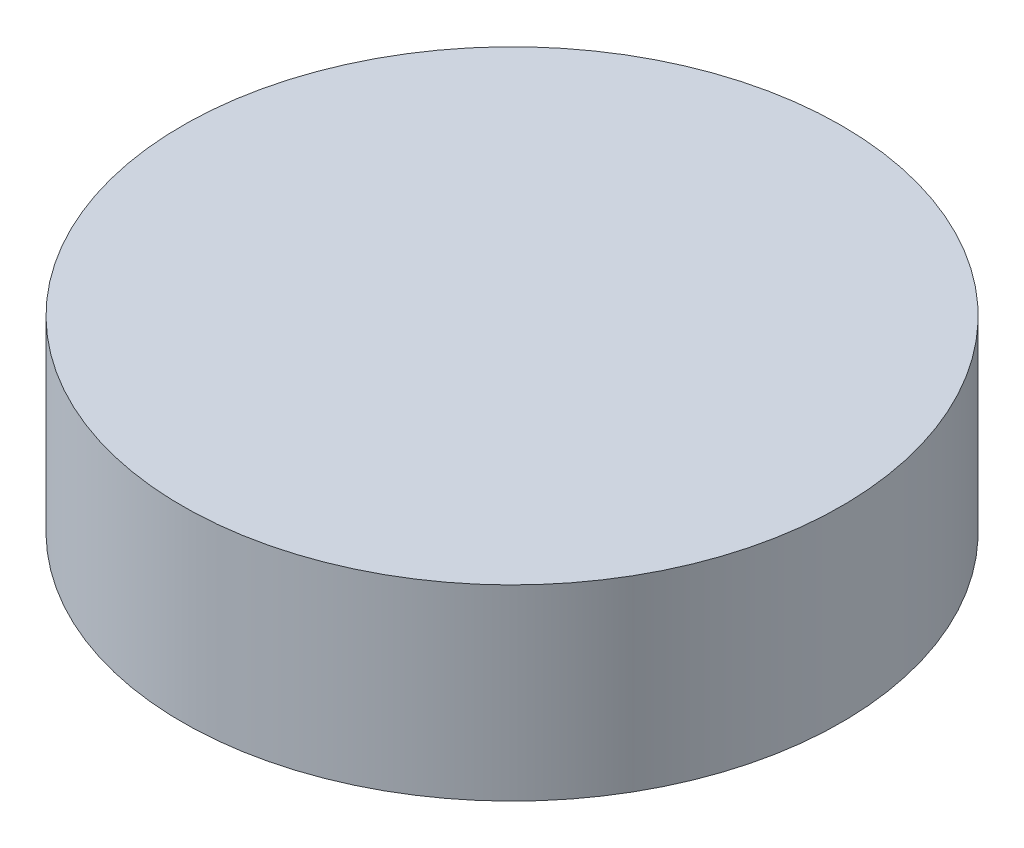
ISO-10303-21;
HEADER;
FILE_DESCRIPTION(('STEP AP214'),'2;1');
FILE_NAME('part.step','',(''),(''),'','','');
FILE_SCHEMA(('AUTOMOTIVE_DESIGN { 1 0 10303 214 1 1 1 1 }'));
ENDSEC;
DATA;
#1=APPLICATION_CONTEXT('core data for automotive mechanical design processes');
#2=APPLICATION_PROTOCOL_DEFINITION('international standard','automotive_design',2000,#1);
#3=PRODUCT_CONTEXT('',#1,'mechanical');
#4=PRODUCT('Part','Part','',(#3));
#5=PRODUCT_RELATED_PRODUCT_CATEGORY('part','',(#4));
#6=PRODUCT_DEFINITION_FORMATION('','',#4);
#7=PRODUCT_DEFINITION_CONTEXT('part definition',#1,'design');
#8=PRODUCT_DEFINITION('design','',#6,#7);
#9=PRODUCT_DEFINITION_SHAPE('','',#8);
#10=(LENGTH_UNIT() NAMED_UNIT(*) SI_UNIT(.MILLI.,.METRE.));
#11=(NAMED_UNIT(*) PLANE_ANGLE_UNIT() SI_UNIT($,.RADIAN.));
#12=(NAMED_UNIT(*) SI_UNIT($,.STERADIAN.) SOLID_ANGLE_UNIT());
#13=UNCERTAINTY_MEASURE_WITH_UNIT(LENGTH_MEASURE(1.E-05),#10,'distance_accuracy_value','');
#14=(GEOMETRIC_REPRESENTATION_CONTEXT(3) GLOBAL_UNCERTAINTY_ASSIGNED_CONTEXT((#13)) GLOBAL_UNIT_ASSIGNED_CONTEXT((#10,
#11,#12)) REPRESENTATION_CONTEXT('',''));
#15=CARTESIAN_POINT('',(0.,0.,0.));
#16=DIRECTION('',(0.,0.,1.));
#17=DIRECTION('',(1.,0.,0.));
#18=AXIS2_PLACEMENT_3D('',#15,#16,#17);
#19=CARTESIAN_POINT('',(0.,152.4,0.));
#20=DIRECTION('',(0.,-1.,0.));
#21=DIRECTION('',(0.,0.,-1.));
#22=AXIS2_PLACEMENT_3D('',#19,#20,#21);
#23=CYLINDRICAL_SURFACE('',#22,268.216999097013);
#24=CARTESIAN_POINT('',(0.,152.4,0.));
#25=DIRECTION('',(0.,1.,0.));
#26=DIRECTION('',(0.,0.,1.));
#27=AXIS2_PLACEMENT_3D('',#24,#25,#26);
#28=CIRCLE('',#27,268.216999097013);
#29=CARTESIAN_POINT('',(0.,152.4,-268.216999097013));
#30=VERTEX_POINT('',#29);
#31=EDGE_CURVE('E10',#30,#30,#28,.T.);
#32=CARTESIAN_POINT('',(0.,0.,0.));
#33=DIRECTION('',(0.,1.,0.));
#34=DIRECTION('',(0.,0.,1.));
#35=AXIS2_PLACEMENT_3D('',#32,#33,#34);
#36=CIRCLE('',#35,268.216999097013);
#37=CARTESIAN_POINT('',(0.,0.,-268.216999097013));
#38=VERTEX_POINT('',#37);
#39=EDGE_CURVE('E34',#38,#38,#36,.T.);
#40=CARTESIAN_POINT('',(0.,152.4,-268.216999097013));
#41=CARTESIAN_POINT('',(0.,150.8125,-268.216999097013));
#42=CARTESIAN_POINT('',(0.,149.225,-268.216999097013));
#43=CARTESIAN_POINT('',(0.,146.05,-268.216999097013));
#44=CARTESIAN_POINT('',(0.,144.4625,-268.216999097013));
#45=CARTESIAN_POINT('',(0.,141.2875,-268.216999097013));
#46=CARTESIAN_POINT('',(0.,139.7,-268.216999097013));
#47=CARTESIAN_POINT('',(0.,136.525,-268.216999097013));
#48=CARTESIAN_POINT('',(0.,134.9375,-268.216999097013));
#49=CARTESIAN_POINT('',(0.,131.7625,-268.216999097013));
#50=CARTESIAN_POINT('',(0.,130.175,-268.216999097013));
#51=CARTESIAN_POINT('',(0.,127.,-268.216999097013));
#52=CARTESIAN_POINT('',(0.,125.4125,-268.216999097013));
#53=CARTESIAN_POINT('',(0.,122.2375,-268.216999097013));
#54=CARTESIAN_POINT('',(0.,120.65,-268.216999097013));
#55=CARTESIAN_POINT('',(0.,117.475,-268.216999097013));
#56=CARTESIAN_POINT('',(0.,115.8875,-268.216999097013));
#57=CARTESIAN_POINT('',(0.,112.7125,-268.216999097013));
#58=CARTESIAN_POINT('',(0.,111.125,-268.216999097013));
#59=CARTESIAN_POINT('',(0.,107.95,-268.216999097013));
#60=CARTESIAN_POINT('',(0.,106.3625,-268.216999097013));
#61=CARTESIAN_POINT('',(0.,103.1875,-268.216999097013));
#62=CARTESIAN_POINT('',(0.,101.6,-268.216999097013));
#63=CARTESIAN_POINT('',(0.,98.425,-268.216999097013));
#64=CARTESIAN_POINT('',(0.,96.8375,-268.216999097013));
#65=CARTESIAN_POINT('',(0.,93.6625,-268.216999097013));
#66=CARTESIAN_POINT('',(0.,92.075,-268.216999097013));
#67=CARTESIAN_POINT('',(0.,88.9,-268.216999097013));
#68=CARTESIAN_POINT('',(0.,87.3125,-268.216999097013));
#69=CARTESIAN_POINT('',(0.,84.1375,-268.216999097013));
#70=CARTESIAN_POINT('',(0.,82.55,-268.216999097013));
#71=CARTESIAN_POINT('',(0.,79.375,-268.216999097013));
#72=CARTESIAN_POINT('',(0.,77.7875,-268.216999097013));
#73=CARTESIAN_POINT('',(0.,74.6125,-268.216999097013));
#74=CARTESIAN_POINT('',(0.,73.025,-268.216999097013));
#75=CARTESIAN_POINT('',(0.,69.85,-268.216999097013));
#76=CARTESIAN_POINT('',(0.,68.2625,-268.216999097013));
#77=CARTESIAN_POINT('',(0.,65.0875,-268.216999097013));
#78=CARTESIAN_POINT('',(0.,63.5,-268.216999097013));
#79=CARTESIAN_POINT('',(0.,60.325,-268.216999097013));
#80=CARTESIAN_POINT('',(0.,58.7375,-268.216999097013));
#81=CARTESIAN_POINT('',(0.,55.5625,-268.216999097013));
#82=CARTESIAN_POINT('',(0.,53.975,-268.216999097013));
#83=CARTESIAN_POINT('',(0.,50.8,-268.216999097013));
#84=CARTESIAN_POINT('',(0.,49.2125,-268.216999097013));
#85=CARTESIAN_POINT('',(0.,46.0375,-268.216999097013));
#86=CARTESIAN_POINT('',(0.,44.45,-268.216999097013));
#87=CARTESIAN_POINT('',(0.,41.275,-268.216999097013));
#88=CARTESIAN_POINT('',(0.,39.6875,-268.216999097013));
#89=CARTESIAN_POINT('',(0.,36.5125,-268.216999097013));
#90=CARTESIAN_POINT('',(0.,34.925,-268.216999097013));
#91=CARTESIAN_POINT('',(0.,31.75,-268.216999097013));
#92=CARTESIAN_POINT('',(0.,30.1625,-268.216999097013));
#93=CARTESIAN_POINT('',(0.,26.9875,-268.216999097013));
#94=CARTESIAN_POINT('',(0.,25.4,-268.216999097013));
#95=CARTESIAN_POINT('',(0.,22.225,-268.216999097013));
#96=CARTESIAN_POINT('',(0.,20.6375,-268.216999097013));
#97=CARTESIAN_POINT('',(0.,17.4625,-268.216999097013));
#98=CARTESIAN_POINT('',(0.,15.875,-268.216999097013));
#99=CARTESIAN_POINT('',(0.,12.7,-268.216999097013));
#100=CARTESIAN_POINT('',(0.,11.1125,-268.216999097013));
#101=CARTESIAN_POINT('',(0.,7.93750000000001,-268.216999097013));
#102=CARTESIAN_POINT('',(0.,6.35,-268.216999097013));
#103=CARTESIAN_POINT('',(0.,3.175,-268.216999097013));
#104=CARTESIAN_POINT('',(0.,1.5875,-268.216999097013));
#105=CARTESIAN_POINT('',(0.,0.,-268.216999097013));
#106=B_SPLINE_CURVE_WITH_KNOTS('',3,(#40,#41,#42,#43,#44,#45,#46,#47,#48,#49,#50,#51,#52,#53,
#54,#55,#56,#57,#58,#59,#60,#61,#62,#63,#64,#65,#66,#67,#68,#69,#70,#71,#72,#73,#74,#75,#76,#77,
#78,#79,#80,#81,#82,#83,#84,#85,#86,#87,#88,#89,#90,#91,#92,#93,#94,#95,#96,#97,#98,#99,#100,
#101,#102,#103,#104,#105),.UNSPECIFIED.,.F.,.F.,(4,2,2,2,2,2,2,2,2,2,2,2,2,2,2,2,2,2,2,2,2,2,2,
2,2,2,2,2,2,2,2,2,4),(0.,4.7625,9.52500000000001,14.2875,19.05,23.8125,28.575,33.3375,38.1,
42.8625,47.625,52.3875,57.15,61.9125,66.675,71.4375,76.2,80.9625,85.725,90.4875,95.25,100.0125,
104.775,109.5375,114.3,119.0625,123.825,128.5875,133.35,138.1125,142.875,147.6375,152.4),.UNSPECIFIED.);
#107=EDGE_CURVE('BSEAM31',#30,#38,#106,.T.);
#108=ORIENTED_EDGE('',*,*,#31,.F.);
#109=ORIENTED_EDGE('',*,*,#39,.T.);
#110=ORIENTED_EDGE('',*,*,#107,.T.);
#111=ORIENTED_EDGE('',*,*,#107,.F.);
#112=EDGE_LOOP('',(#108,#110,#109,#111));
#113=FACE_BOUND('',#112,.T.);
#114=ADVANCED_FACE('F31',(#113),#23,.T.);
#115=CARTESIAN_POINT('',(0.,152.4,0.));
#116=DIRECTION('',(0.,1.,0.));
#117=DIRECTION('',(0.,0.,1.));
#118=AXIS2_PLACEMENT_3D('',#115,#116,#117);
#119=PLANE('',#118);
#120=ORIENTED_EDGE('',*,*,#31,.T.);
#121=EDGE_LOOP('',(#120));
#122=FACE_BOUND('',#121,.T.);
#123=ADVANCED_FACE('F46',(#122),#119,.T.);
#124=CARTESIAN_POINT('',(0.,0.,0.));
#125=DIRECTION('',(0.,1.,0.));
#126=DIRECTION('',(0.,0.,1.));
#127=AXIS2_PLACEMENT_3D('',#124,#125,#126);
#128=PLANE('',#127);
#129=ORIENTED_EDGE('',*,*,#39,.F.);
#130=EDGE_LOOP('',(#129));
#131=FACE_BOUND('',#130,.T.);
#132=ADVANCED_FACE('F44',(#131),#128,.F.);
#133=CLOSED_SHELL('',(#114,#123,#132));
#134=MANIFOLD_SOLID_BREP('B2',#133);
#135=ADVANCED_BREP_SHAPE_REPRESENTATION('',(#18,#134),#14);
#136=SHAPE_DEFINITION_REPRESENTATION(#9,#135);
ENDSEC;
END-ISO-10303-21;
